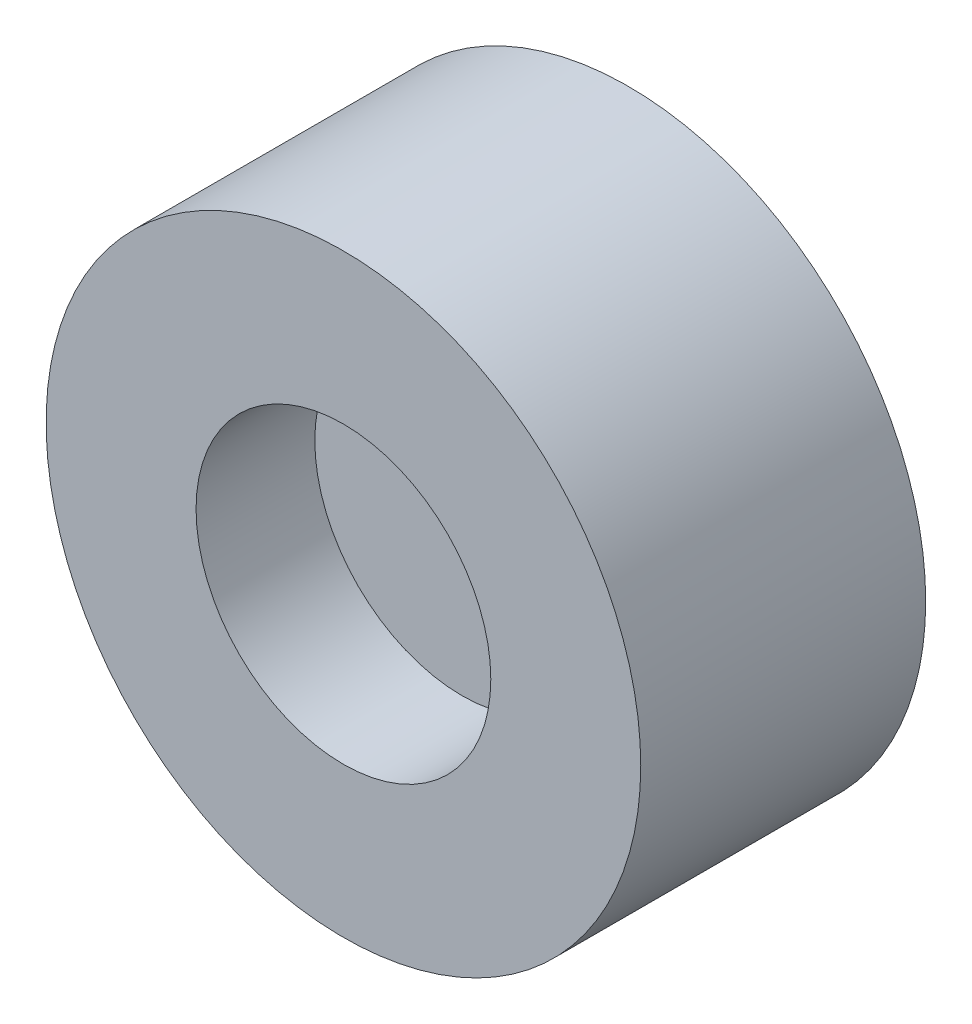
ISO-10303-21;
HEADER;
FILE_DESCRIPTION(('STEP AP214'),'2;1');
FILE_NAME('part.step','',(''),(''),'','','');
FILE_SCHEMA(('AUTOMOTIVE_DESIGN { 1 0 10303 214 1 1 1 1 }'));
ENDSEC;
DATA;
#1=APPLICATION_CONTEXT('core data for automotive mechanical design processes');
#2=APPLICATION_PROTOCOL_DEFINITION('international standard','automotive_design',2000,#1);
#3=PRODUCT_CONTEXT('',#1,'mechanical');
#4=PRODUCT('Part','Part','',(#3));
#5=PRODUCT_RELATED_PRODUCT_CATEGORY('part','',(#4));
#6=PRODUCT_DEFINITION_FORMATION('','',#4);
#7=PRODUCT_DEFINITION_CONTEXT('part definition',#1,'design');
#8=PRODUCT_DEFINITION('design','',#6,#7);
#9=PRODUCT_DEFINITION_SHAPE('','',#8);
#10=(LENGTH_UNIT() NAMED_UNIT(*) SI_UNIT(.MILLI.,.METRE.));
#11=(NAMED_UNIT(*) PLANE_ANGLE_UNIT() SI_UNIT($,.RADIAN.));
#12=(NAMED_UNIT(*) SI_UNIT($,.STERADIAN.) SOLID_ANGLE_UNIT());
#13=UNCERTAINTY_MEASURE_WITH_UNIT(LENGTH_MEASURE(1.E-05),#10,'distance_accuracy_value','');
#14=(GEOMETRIC_REPRESENTATION_CONTEXT(3) GLOBAL_UNCERTAINTY_ASSIGNED_CONTEXT((#13)) GLOBAL_UNIT_ASSIGNED_CONTEXT((#10,
#11,#12)) REPRESENTATION_CONTEXT('',''));
#15=CARTESIAN_POINT('',(0.,0.,0.));
#16=DIRECTION('',(0.,0.,1.));
#17=DIRECTION('',(1.,0.,0.));
#18=AXIS2_PLACEMENT_3D('',#15,#16,#17);
#19=CARTESIAN_POINT('',(0.,0.,-5.));
#20=DIRECTION('',(0.,0.,1.));
#21=DIRECTION('',(1.,0.,0.));
#22=AXIS2_PLACEMENT_3D('',#19,#20,#21);
#23=CYLINDRICAL_SURFACE('',#22,3.06704709431982);
#24=CARTESIAN_POINT('',(0.,0.,-5.));
#25=DIRECTION('',(0.,0.,1.));
#26=DIRECTION('',(1.,0.,0.));
#27=AXIS2_PLACEMENT_3D('',#24,#25,#26);
#28=CIRCLE('',#27,3.06704709431982);
#29=CARTESIAN_POINT('',(3.06704709431982,0.,-5.));
#30=VERTEX_POINT('',#29);
#31=EDGE_CURVE('E35',#30,#30,#28,.T.);
#32=ORIENTED_EDGE('',*,*,#31,.F.);
#33=EDGE_LOOP('',(#32));
#34=FACE_BOUND('',#33,.T.);
#35=CARTESIAN_POINT('',(0.,0.,5.));
#36=DIRECTION('',(0.,0.,1.));
#37=DIRECTION('',(1.,0.,0.));
#38=AXIS2_PLACEMENT_3D('',#35,#36,#37);
#39=CIRCLE('',#38,3.06704709431982);
#40=CARTESIAN_POINT('',(3.06704709431982,0.,5.));
#41=VERTEX_POINT('',#40);
#42=EDGE_CURVE('E39',#41,#41,#39,.T.);
#43=ORIENTED_EDGE('',*,*,#42,.T.);
#44=EDGE_LOOP('',(#43));
#45=FACE_BOUND('',#44,.T.);
#46=ADVANCED_FACE('F29',(#34,#45),#23,.F.);
#47=CARTESIAN_POINT('',(0.,-137.869877344693,-5.));
#48=DIRECTION('',(0.,0.,1.));
#49=DIRECTION('',(1.,0.,0.));
#50=AXIS2_PLACEMENT_3D('',#47,#48,#49);
#51=PLANE('',#50);
#52=ORIENTED_EDGE('',*,*,#31,.T.);
#53=EDGE_LOOP('',(#52));
#54=FACE_BOUND('',#53,.T.);
#55=CARTESIAN_POINT('',(0.,0.,-5.));
#56=DIRECTION('',(0.,0.,1.));
#57=DIRECTION('',(1.,0.,0.));
#58=AXIS2_PLACEMENT_3D('',#55,#56,#57);
#59=CIRCLE('',#58,31.0313000131182);
#60=CARTESIAN_POINT('',(31.0313000131182,0.,-5.));
#61=VERTEX_POINT('',#60);
#62=EDGE_CURVE('E10',#61,#61,#59,.T.);
#63=ORIENTED_EDGE('',*,*,#62,.F.);
#64=EDGE_LOOP('',(#63));
#65=FACE_BOUND('',#64,.T.);
#66=ADVANCED_FACE('F84',(#54,#65),#51,.F.);
#67=CARTESIAN_POINT('',(0.,-137.869877344693,5.));
#68=DIRECTION('',(0.,0.,1.));
#69=DIRECTION('',(1.,0.,0.));
#70=AXIS2_PLACEMENT_3D('',#67,#68,#69);
#71=PLANE('',#70);
#72=ORIENTED_EDGE('',*,*,#42,.F.);
#73=EDGE_LOOP('',(#72));
#74=FACE_BOUND('',#73,.T.);
#75=CARTESIAN_POINT('',(0.,0.,5.));
#76=DIRECTION('',(0.,0.,1.));
#77=DIRECTION('',(1.,0.,0.));
#78=AXIS2_PLACEMENT_3D('',#75,#76,#77);
#79=CIRCLE('',#78,31.0313000131182);
#80=CARTESIAN_POINT('',(31.0313000131182,0.,5.));
#81=VERTEX_POINT('',#80);
#82=EDGE_CURVE('E43',#81,#81,#79,.T.);
#83=ORIENTED_EDGE('',*,*,#82,.T.);
#84=EDGE_LOOP('',(#83));
#85=FACE_BOUND('',#84,.T.);
#86=ADVANCED_FACE('F89',(#74,#85),#71,.T.);
#87=CARTESIAN_POINT('',(0.,0.,-30.));
#88=DIRECTION('',(0.,0.,1.));
#89=DIRECTION('',(1.,0.,0.));
#90=AXIS2_PLACEMENT_3D('',#87,#88,#89);
#91=CYLINDRICAL_SURFACE('',#90,31.0313000131182);
#92=CARTESIAN_POINT('',(0.,0.,-30.));
#93=DIRECTION('',(0.,0.,1.));
#94=DIRECTION('',(1.,0.,0.));
#95=AXIS2_PLACEMENT_3D('',#92,#93,#94);
#96=CIRCLE('',#95,31.0313000131182);
#97=CARTESIAN_POINT('',(31.0313000131182,0.,-30.));
#98=VERTEX_POINT('',#97);
#99=EDGE_CURVE('E51',#98,#98,#96,.T.);
#100=ORIENTED_EDGE('',*,*,#99,.F.);
#101=EDGE_LOOP('',(#100));
#102=FACE_BOUND('',#101,.T.);
#103=ORIENTED_EDGE('',*,*,#62,.T.);
#104=EDGE_LOOP('',(#103));
#105=FACE_BOUND('',#104,.T.);
#106=ADVANCED_FACE('F80',(#102,#105),#91,.F.);
#107=ORIENTED_EDGE('',*,*,#82,.F.);
#108=EDGE_LOOP('',(#107));
#109=FACE_BOUND('',#108,.T.);
#110=CARTESIAN_POINT('',(0.,0.,30.));
#111=DIRECTION('',(0.,0.,1.));
#112=DIRECTION('',(1.,0.,0.));
#113=AXIS2_PLACEMENT_3D('',#110,#111,#112);
#114=CIRCLE('',#113,31.0313000131182);
#115=CARTESIAN_POINT('',(31.0313000131182,0.,30.));
#116=VERTEX_POINT('',#115);
#117=EDGE_CURVE('E57',#116,#116,#114,.T.);
#118=ORIENTED_EDGE('',*,*,#117,.T.);
#119=EDGE_LOOP('',(#118));
#120=FACE_BOUND('',#119,.T.);
#121=ADVANCED_FACE('F61',(#109,#120),#91,.F.);
#122=CARTESIAN_POINT('',(0.,0.,-30.));
#123=DIRECTION('',(0.,0.,1.));
#124=DIRECTION('',(1.,0.,0.));
#125=AXIS2_PLACEMENT_3D('',#122,#123,#124);
#126=CYLINDRICAL_SURFACE('',#125,62.6038436311164);
#127=CARTESIAN_POINT('',(0.,0.,-30.));
#128=DIRECTION('',(0.,0.,1.));
#129=DIRECTION('',(1.,0.,0.));
#130=AXIS2_PLACEMENT_3D('',#127,#128,#129);
#131=CIRCLE('',#130,62.6038436311164);
#132=CARTESIAN_POINT('',(62.6038436311164,0.,-30.));
#133=VERTEX_POINT('',#132);
#134=EDGE_CURVE('E48',#133,#133,#131,.T.);
#135=ORIENTED_EDGE('',*,*,#134,.T.);
#136=EDGE_LOOP('',(#135));
#137=FACE_BOUND('',#136,.T.);
#138=CARTESIAN_POINT('',(0.,0.,30.));
#139=DIRECTION('',(0.,0.,1.));
#140=DIRECTION('',(1.,0.,0.));
#141=AXIS2_PLACEMENT_3D('',#138,#139,#140);
#142=CIRCLE('',#141,62.6038436311164);
#143=CARTESIAN_POINT('',(62.6038436311164,0.,30.));
#144=VERTEX_POINT('',#143);
#145=EDGE_CURVE('E54',#144,#144,#142,.T.);
#146=ORIENTED_EDGE('',*,*,#145,.F.);
#147=EDGE_LOOP('',(#146));
#148=FACE_BOUND('',#147,.T.);
#149=ADVANCED_FACE('F70',(#137,#148),#126,.T.);
#150=CARTESIAN_POINT('',(0.,-137.869877344693,-30.));
#151=DIRECTION('',(0.,0.,1.));
#152=DIRECTION('',(1.,0.,0.));
#153=AXIS2_PLACEMENT_3D('',#150,#151,#152);
#154=PLANE('',#153);
#155=ORIENTED_EDGE('',*,*,#99,.T.);
#156=EDGE_LOOP('',(#155));
#157=FACE_BOUND('',#156,.T.);
#158=ORIENTED_EDGE('',*,*,#134,.F.);
#159=EDGE_LOOP('',(#158));
#160=FACE_BOUND('',#159,.T.);
#161=ADVANCED_FACE('F66',(#157,#160),#154,.F.);
#162=CARTESIAN_POINT('',(0.,-137.869877344693,30.));
#163=DIRECTION('',(0.,0.,1.));
#164=DIRECTION('',(1.,0.,0.));
#165=AXIS2_PLACEMENT_3D('',#162,#163,#164);
#166=PLANE('',#165);
#167=ORIENTED_EDGE('',*,*,#117,.F.);
#168=EDGE_LOOP('',(#167));
#169=FACE_BOUND('',#168,.T.);
#170=ORIENTED_EDGE('',*,*,#145,.T.);
#171=EDGE_LOOP('',(#170));
#172=FACE_BOUND('',#171,.T.);
#173=ADVANCED_FACE('F63',(#169,#172),#166,.T.);
#174=CLOSED_SHELL('',(#46,#66,#86,#106,#121,#149,#161,#173));
#175=MANIFOLD_SOLID_BREP('B2',#174);
#176=ADVANCED_BREP_SHAPE_REPRESENTATION('',(#18,#175),#14);
#177=SHAPE_DEFINITION_REPRESENTATION(#9,#176);
ENDSEC;
END-ISO-10303-21;
